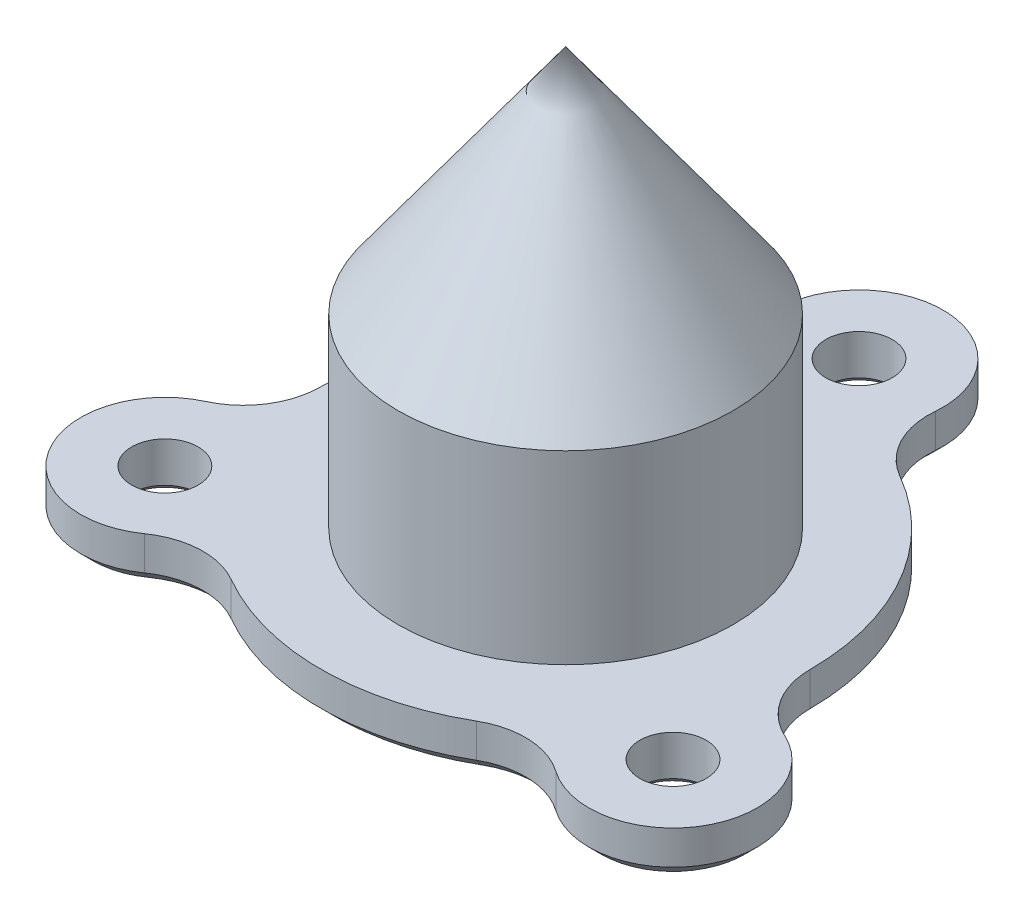
ISO-10303-21;
HEADER;
FILE_DESCRIPTION(('STEP AP214'),'2;1');
FILE_NAME('part.step','',(''),(''),'','','');
FILE_SCHEMA(('AUTOMOTIVE_DESIGN { 1 0 10303 214 1 1 1 1 }'));
ENDSEC;
DATA;
#1=APPLICATION_CONTEXT('core data for automotive mechanical design processes');
#2=APPLICATION_PROTOCOL_DEFINITION('international standard','automotive_design',2000,#1);
#3=PRODUCT_CONTEXT('',#1,'mechanical');
#4=PRODUCT('Part','Part','',(#3));
#5=PRODUCT_RELATED_PRODUCT_CATEGORY('part','',(#4));
#6=PRODUCT_DEFINITION_FORMATION('','',#4);
#7=PRODUCT_DEFINITION_CONTEXT('part definition',#1,'design');
#8=PRODUCT_DEFINITION('design','',#6,#7);
#9=PRODUCT_DEFINITION_SHAPE('','',#8);
#10=(LENGTH_UNIT() NAMED_UNIT(*) SI_UNIT(.MILLI.,.METRE.));
#11=(NAMED_UNIT(*) PLANE_ANGLE_UNIT() SI_UNIT($,.RADIAN.));
#12=(NAMED_UNIT(*) SI_UNIT($,.STERADIAN.) SOLID_ANGLE_UNIT());
#13=UNCERTAINTY_MEASURE_WITH_UNIT(LENGTH_MEASURE(1.E-05),#10,'distance_accuracy_value','');
#14=(GEOMETRIC_REPRESENTATION_CONTEXT(3) GLOBAL_UNCERTAINTY_ASSIGNED_CONTEXT((#13)) GLOBAL_UNIT_ASSIGNED_CONTEXT((#10,
#11,#12)) REPRESENTATION_CONTEXT('',''));
#15=CARTESIAN_POINT('',(0.,0.,0.));
#16=DIRECTION('',(0.,0.,1.));
#17=DIRECTION('',(1.,0.,0.));
#18=AXIS2_PLACEMENT_3D('',#15,#16,#17);
#19=CARTESIAN_POINT('',(5.20410255939998,3.,-9.03315789473684));
#20=DIRECTION('',(0.,1.,0.));
#21=DIRECTION('',(0.,0.,1.));
#22=AXIS2_PLACEMENT_3D('',#19,#20,#21);
#23=PLANE('',#22);
#24=CARTESIAN_POINT('',(16.4544826719043,3.,9.50000000000008));
#25=DIRECTION('',(0.,1.,0.));
#26=DIRECTION('',(0.,0.,1.));
#27=AXIS2_PLACEMENT_3D('',#24,#25,#26);
#28=CIRCLE('',#27,2.15);
#29=CARTESIAN_POINT('',(16.4544826719043,3.,11.6500000000001));
#30=VERTEX_POINT('',#29);
#31=EDGE_CURVE('E178',#30,#30,#28,.T.);
#32=ORIENTED_EDGE('',*,*,#31,.F.);
#33=EDGE_LOOP('',(#32));
#34=FACE_BOUND('',#33,.T.);
#35=CARTESIAN_POINT('',(0.,3.,0.));
#36=DIRECTION('',(0.,1.,0.));
#37=DIRECTION('',(0.,0.,1.));
#38=AXIS2_PLACEMENT_3D('',#35,#36,#37);
#39=CIRCLE('',#38,10.85);
#40=CARTESIAN_POINT('',(0.,3.,10.85));
#41=VERTEX_POINT('',#40);
#42=EDGE_CURVE('E189',#41,#41,#39,.T.);
#43=ORIENTED_EDGE('',*,*,#42,.F.);
#44=EDGE_LOOP('',(#43));
#45=FACE_BOUND('',#44,.T.);
#46=CARTESIAN_POINT('',(0.,3.,0.));
#47=DIRECTION('',(0.,1.,0.));
#48=DIRECTION('',(0.,0.,1.));
#49=AXIS2_PLACEMENT_3D('',#46,#47,#48);
#50=CIRCLE('',#49,15.85);
#51=CARTESIAN_POINT('',(15.8499931475365,3.,0.0147384885755792));
#52=VERTEX_POINT('',#51);
#53=CARTESIAN_POINT('',(7.91223266824842,3.,-13.7338659598637));
#54=VERTEX_POINT('',#53);
#55=EDGE_CURVE('E192',#52,#54,#50,.T.);
#56=ORIENTED_EDGE('',*,*,#55,.T.);
#57=CARTESIAN_POINT('',(10.4082051188,3.,-18.0663157894737));
#58=DIRECTION('',(0.,-1.,0.));
#59=DIRECTION('',(0.,0.,1.));
#60=AXIS2_PLACEMENT_3D('',#57,#58,#59);
#61=CIRCLE('',#60,5.);
#62=CARTESIAN_POINT('',(5.42820266961338,3.,-18.5130546461848));
#63=VERTEX_POINT('',#62);
#64=EDGE_CURVE('E195',#54,#63,#61,.T.);
#65=ORIENTED_EDGE('',*,*,#64,.T.);
#66=CARTESIAN_POINT('',(0.,3.,-19.));
#67=DIRECTION('',(0.,1.,0.));
#68=DIRECTION('',(0.,0.,1.));
#69=AXIS2_PLACEMENT_3D('',#66,#67,#68);
#70=CIRCLE('',#69,5.45);
#71=CARTESIAN_POINT('',(-5.42820266961338,3.,-18.5130546461848));
#72=VERTEX_POINT('',#71);
#73=EDGE_CURVE('E197',#63,#72,#70,.T.);
#74=ORIENTED_EDGE('',*,*,#73,.T.);
#75=CARTESIAN_POINT('',(-10.4082051188,3.,-18.0663157894737));
#76=DIRECTION('',(0.,-1.,0.));
#77=DIRECTION('',(0.,0.,-1.));
#78=AXIS2_PLACEMENT_3D('',#75,#76,#77);
#79=CIRCLE('',#78,5.);
#80=CARTESIAN_POINT('',(-7.91223266824842,3.,-13.7338659598637));
#81=VERTEX_POINT('',#80);
#82=EDGE_CURVE('E199',#72,#81,#79,.T.);
#83=ORIENTED_EDGE('',*,*,#82,.T.);
#84=CARTESIAN_POINT('',(0.,3.,0.));
#85=DIRECTION('',(0.,1.,0.));
#86=DIRECTION('',(0.,0.,1.));
#87=AXIS2_PLACEMENT_3D('',#84,#85,#86);
#88=CIRCLE('',#87,15.85);
#89=CARTESIAN_POINT('',(-15.8499931475365,3.,0.014738488575585));
#90=VERTEX_POINT('',#89);
#91=EDGE_CURVE('E201',#81,#90,#88,.T.);
#92=ORIENTED_EDGE('',*,*,#91,.T.);
#93=CARTESIAN_POINT('',(-20.8499909858761,3.,0.0193878540568474));
#94=DIRECTION('',(0.,-1.,0.));
#95=DIRECTION('',(0.,0.,1.));
#96=AXIS2_PLACEMENT_3D('',#93,#94,#95);
#97=CIRCLE('',#96,5.);
#98=CARTESIAN_POINT('',(-18.7468769600523,3.,4.55556591431673));
#99=VERTEX_POINT('',#98);
#100=EDGE_CURVE('E203',#90,#99,#97,.T.);
#101=ORIENTED_EDGE('',*,*,#100,.T.);
#102=CARTESIAN_POINT('',(-16.4544826719044,3.,9.49999999999985));
#103=DIRECTION('',(0.,1.,0.));
#104=DIRECTION('',(0.,0.,1.));
#105=AXIS2_PLACEMENT_3D('',#102,#103,#104);
#106=CIRCLE('',#105,5.45);
#107=CARTESIAN_POINT('',(-13.318674290439,3.,13.957488731868));
#108=VERTEX_POINT('',#107);
#109=EDGE_CURVE('E205',#99,#108,#106,.T.);
#110=ORIENTED_EDGE('',*,*,#109,.T.);
#111=CARTESIAN_POINT('',(-10.4417858670761,3.,18.0469279354169));
#112=DIRECTION('',(0.,-1.,0.));
#113=DIRECTION('',(0.,0.,-1.));
#114=AXIS2_PLACEMENT_3D('',#111,#112,#113);
#115=CIRCLE('',#114,5.);
#116=CARTESIAN_POINT('',(-7.93776047928809,3.,13.7191274712881));
#117=VERTEX_POINT('',#116);
#118=EDGE_CURVE('E207',#108,#117,#115,.T.);
#119=ORIENTED_EDGE('',*,*,#118,.T.);
#120=CARTESIAN_POINT('',(0.,3.,0.));
#121=DIRECTION('',(0.,1.,0.));
#122=DIRECTION('',(0.,0.,1.));
#123=AXIS2_PLACEMENT_3D('',#120,#121,#122);
#124=CIRCLE('',#123,15.85);
#125=CARTESIAN_POINT('',(7.93776047928811,3.,13.7191274712881));
#126=VERTEX_POINT('',#125);
#127=EDGE_CURVE('E209',#117,#126,#124,.T.);
#128=ORIENTED_EDGE('',*,*,#127,.T.);
#129=CARTESIAN_POINT('',(10.4417858670761,3.,18.0469279354168));
#130=DIRECTION('',(0.,-1.,0.));
#131=DIRECTION('',(0.,0.,1.));
#132=AXIS2_PLACEMENT_3D('',#129,#130,#131);
#133=CIRCLE('',#132,5.);
#134=CARTESIAN_POINT('',(13.3186742904389,3.,13.9574887318681));
#135=VERTEX_POINT('',#134);
#136=EDGE_CURVE('E211',#126,#135,#133,.T.);
#137=ORIENTED_EDGE('',*,*,#136,.T.);
#138=CARTESIAN_POINT('',(16.4544826719043,3.,9.50000000000008));
#139=DIRECTION('',(0.,1.,0.));
#140=DIRECTION('',(0.,0.,1.));
#141=AXIS2_PLACEMENT_3D('',#138,#139,#140);
#142=CIRCLE('',#141,5.45);
#143=CARTESIAN_POINT('',(18.7468769600523,3.,4.55556591431681));
#144=VERTEX_POINT('',#143);
#145=EDGE_CURVE('E213',#135,#144,#142,.T.);
#146=ORIENTED_EDGE('',*,*,#145,.T.);
#147=CARTESIAN_POINT('',(20.8499909858761,3.,0.0193878540568318));
#148=DIRECTION('',(0.,-1.,0.));
#149=DIRECTION('',(0.,0.,-1.));
#150=AXIS2_PLACEMENT_3D('',#147,#148,#149);
#151=CIRCLE('',#150,5.00000000000001);
#152=EDGE_CURVE('E215',#144,#52,#151,.T.);
#153=ORIENTED_EDGE('',*,*,#152,.T.);
#154=EDGE_LOOP('',(#56,#65,#74,#83,#92,#101,#110,#119,#128,#137,#146,#153));
#155=FACE_BOUND('',#154,.T.);
#156=CARTESIAN_POINT('',(0.,3.,-19.));
#157=DIRECTION('',(0.,1.,0.));
#158=DIRECTION('',(0.,0.,1.));
#159=AXIS2_PLACEMENT_3D('',#156,#157,#158);
#160=CIRCLE('',#159,2.15);
#161=CARTESIAN_POINT('',(0.,3.,-16.85));
#162=VERTEX_POINT('',#161);
#163=EDGE_CURVE('E186',#162,#162,#160,.T.);
#164=ORIENTED_EDGE('',*,*,#163,.F.);
#165=EDGE_LOOP('',(#164));
#166=FACE_BOUND('',#165,.T.);
#167=CARTESIAN_POINT('',(-16.4544826719044,3.,9.49999999999985));
#168=DIRECTION('',(0.,1.,0.));
#169=DIRECTION('',(0.,0.,1.));
#170=AXIS2_PLACEMENT_3D('',#167,#168,#169);
#171=CIRCLE('',#170,2.15);
#172=CARTESIAN_POINT('',(-16.4544826719044,3.,11.6499999999999));
#173=VERTEX_POINT('',#172);
#174=EDGE_CURVE('E174',#173,#173,#171,.T.);
#175=ORIENTED_EDGE('',*,*,#174,.F.);
#176=EDGE_LOOP('',(#175));
#177=FACE_BOUND('',#176,.T.);
#178=ADVANCED_FACE('F35',(#34,#45,#155,#166,#177),#23,.T.);
#179=CARTESIAN_POINT('',(5.20410255939998,0.,-9.03315789473684));
#180=DIRECTION('',(0.,1.,0.));
#181=DIRECTION('',(0.,0.,1.));
#182=AXIS2_PLACEMENT_3D('',#179,#180,#181);
#183=PLANE('',#182);
#184=CARTESIAN_POINT('',(-16.4544826719044,0.,9.49999999999985));
#185=DIRECTION('',(0.,1.,0.));
#186=DIRECTION('',(0.,0.,1.));
#187=AXIS2_PLACEMENT_3D('',#184,#185,#186);
#188=CIRCLE('',#187,2.54999999999999);
#189=CARTESIAN_POINT('',(-16.4544826719044,0.,12.0499999999998));
#190=VERTEX_POINT('',#189);
#191=EDGE_CURVE('E334',#190,#190,#188,.T.);
#192=ORIENTED_EDGE('',*,*,#191,.T.);
#193=EDGE_LOOP('',(#192));
#194=FACE_BOUND('',#193,.T.);
#195=CARTESIAN_POINT('',(16.4544826719043,0.,9.50000000000008));
#196=DIRECTION('',(0.,1.,0.));
#197=DIRECTION('',(0.,0.,1.));
#198=AXIS2_PLACEMENT_3D('',#195,#196,#197);
#199=CIRCLE('',#198,2.55);
#200=CARTESIAN_POINT('',(16.4544826719043,0.,12.0500000000001));
#201=VERTEX_POINT('',#200);
#202=EDGE_CURVE('E331',#201,#201,#199,.T.);
#203=ORIENTED_EDGE('',*,*,#202,.T.);
#204=EDGE_LOOP('',(#203));
#205=FACE_BOUND('',#204,.T.);
#206=CARTESIAN_POINT('',(0.,0.,-19.));
#207=DIRECTION('',(0.,1.,0.));
#208=DIRECTION('',(0.,0.,1.));
#209=AXIS2_PLACEMENT_3D('',#206,#207,#208);
#210=CIRCLE('',#209,2.55);
#211=CARTESIAN_POINT('',(0.,0.,-16.45));
#212=VERTEX_POINT('',#211);
#213=EDGE_CURVE('E298',#212,#212,#210,.T.);
#214=ORIENTED_EDGE('',*,*,#213,.T.);
#215=EDGE_LOOP('',(#214));
#216=FACE_BOUND('',#215,.T.);
#217=CARTESIAN_POINT('',(-10.4082051188,0.,-18.0663157894737));
#218=DIRECTION('',(0.,1.,0.));
#219=DIRECTION('',(0.,0.,1.));
#220=AXIS2_PLACEMENT_3D('',#217,#218,#219);
#221=CIRCLE('',#220,5.8);
#222=CARTESIAN_POINT('',(-7.51287707616017,0.,-13.0406739871261));
#223=VERTEX_POINT('',#222);
#224=CARTESIAN_POINT('',(-4.63140227774353,0.,-18.5845328632586));
#225=VERTEX_POINT('',#224);
#226=EDGE_CURVE('E273',#223,#225,#221,.T.);
#227=ORIENTED_EDGE('',*,*,#226,.T.);
#228=CARTESIAN_POINT('',(0.,0.,-19.));
#229=DIRECTION('',(0.,1.,0.));
#230=DIRECTION('',(0.,0.,1.));
#231=AXIS2_PLACEMENT_3D('',#228,#229,#230);
#232=CIRCLE('',#231,4.65);
#233=CARTESIAN_POINT('',(4.63140227774353,0.,-18.5845328632586));
#234=VERTEX_POINT('',#233);
#235=EDGE_CURVE('E275',#225,#234,#232,.F.);
#236=ORIENTED_EDGE('',*,*,#235,.T.);
#237=CARTESIAN_POINT('',(10.4082051188,0.,-18.0663157894737));
#238=DIRECTION('',(0.,1.,0.));
#239=DIRECTION('',(0.,0.,1.));
#240=AXIS2_PLACEMENT_3D('',#237,#238,#239);
#241=CIRCLE('',#240,5.8);
#242=CARTESIAN_POINT('',(7.51287707616017,0.,-13.0406739871261));
#243=VERTEX_POINT('',#242);
#244=EDGE_CURVE('E271',#234,#243,#241,.T.);
#245=ORIENTED_EDGE('',*,*,#244,.T.);
#246=CARTESIAN_POINT('',(0.,0.,0.));
#247=DIRECTION('',(0.,1.,0.));
#248=DIRECTION('',(0.,0.,1.));
#249=AXIS2_PLACEMENT_3D('',#246,#247,#248);
#250=CIRCLE('',#249,15.05);
#251=CARTESIAN_POINT('',(15.0499934934022,0.,0.0139945900985783));
#252=VERTEX_POINT('',#251);
#253=EDGE_CURVE('E267',#243,#252,#250,.F.);
#254=ORIENTED_EDGE('',*,*,#253,.T.);
#255=CARTESIAN_POINT('',(20.8499909858761,0.,0.0193878540568318));
#256=DIRECTION('',(0.,1.,0.));
#257=DIRECTION('',(0.,0.,1.));
#258=AXIS2_PLACEMENT_3D('',#255,#256,#257);
#259=CIRCLE('',#258,5.8);
#260=CARTESIAN_POINT('',(18.4103787159204,0.,5.28135440395839));
#261=VERTEX_POINT('',#260);
#262=EDGE_CURVE('E263',#252,#261,#259,.T.);
#263=ORIENTED_EDGE('',*,*,#262,.T.);
#264=CARTESIAN_POINT('',(16.4544826719043,0.,9.50000000000008));
#265=DIRECTION('',(0.,1.,0.));
#266=DIRECTION('',(0.,0.,1.));
#267=AXIS2_PLACEMENT_3D('',#264,#265,#266);
#268=CIRCLE('',#267,4.65);
#269=CARTESIAN_POINT('',(13.778976438177,0.,13.3031784593003));
#270=VERTEX_POINT('',#269);
#271=EDGE_CURVE('E259',#261,#270,#268,.F.);
#272=ORIENTED_EDGE('',*,*,#271,.T.);
#273=CARTESIAN_POINT('',(10.4417858670761,0.,18.0469279354168));
#274=DIRECTION('',(0.,1.,0.));
#275=DIRECTION('',(0.,0.,1.));
#276=AXIS2_PLACEMENT_3D('',#273,#274,#275);
#277=CIRCLE('',#276,5.8);
#278=CARTESIAN_POINT('',(7.53711641724202,0.,13.0266793970275));
#279=VERTEX_POINT('',#278);
#280=EDGE_CURVE('E255',#270,#279,#277,.T.);
#281=ORIENTED_EDGE('',*,*,#280,.T.);
#282=CARTESIAN_POINT('',(0.,0.,0.));
#283=DIRECTION('',(0.,1.,0.));
#284=DIRECTION('',(0.,0.,1.));
#285=AXIS2_PLACEMENT_3D('',#282,#283,#284);
#286=CIRCLE('',#285,15.05);
#287=CARTESIAN_POINT('',(-7.537116417242,0.,13.0266793970275));
#288=VERTEX_POINT('',#287);
#289=EDGE_CURVE('E253',#279,#288,#286,.F.);
#290=ORIENTED_EDGE('',*,*,#289,.T.);
#291=CARTESIAN_POINT('',(-10.4417858670761,0.,18.0469279354169));
#292=DIRECTION('',(0.,1.,0.));
#293=DIRECTION('',(0.,0.,1.));
#294=AXIS2_PLACEMENT_3D('',#291,#292,#293);
#295=CIRCLE('',#294,5.8);
#296=CARTESIAN_POINT('',(-13.7789764381769,0.,13.3031784593003));
#297=VERTEX_POINT('',#296);
#298=EDGE_CURVE('E257',#288,#297,#295,.T.);
#299=ORIENTED_EDGE('',*,*,#298,.T.);
#300=CARTESIAN_POINT('',(-16.4544826719044,0.,9.49999999999985));
#301=DIRECTION('',(0.,1.,0.));
#302=DIRECTION('',(0.,0.,1.));
#303=AXIS2_PLACEMENT_3D('',#300,#301,#302);
#304=CIRCLE('',#303,4.65);
#305=CARTESIAN_POINT('',(-18.4103787159206,0.,5.28135440395815));
#306=VERTEX_POINT('',#305);
#307=EDGE_CURVE('E261',#297,#306,#304,.F.);
#308=ORIENTED_EDGE('',*,*,#307,.T.);
#309=CARTESIAN_POINT('',(-20.8499909858761,0.,0.0193878540568474));
#310=DIRECTION('',(0.,1.,0.));
#311=DIRECTION('',(0.,0.,1.));
#312=AXIS2_PLACEMENT_3D('',#309,#310,#311);
#313=CIRCLE('',#312,5.8);
#314=CARTESIAN_POINT('',(-15.0499934934022,0.,0.0139945900985839));
#315=VERTEX_POINT('',#314);
#316=EDGE_CURVE('E265',#306,#315,#313,.T.);
#317=ORIENTED_EDGE('',*,*,#316,.T.);
#318=CARTESIAN_POINT('',(0.,0.,0.));
#319=DIRECTION('',(0.,1.,0.));
#320=DIRECTION('',(0.,0.,1.));
#321=AXIS2_PLACEMENT_3D('',#318,#319,#320);
#322=CIRCLE('',#321,15.05);
#323=EDGE_CURVE('E269',#315,#223,#322,.F.);
#324=ORIENTED_EDGE('',*,*,#323,.T.);
#325=EDGE_LOOP('',(#227,#236,#245,#254,#263,#272,#281,#290,#299,#308,#317,#324));
#326=FACE_BOUND('',#325,.T.);
#327=ADVANCED_FACE('F351',(#194,#205,#216,#326),#183,.F.);
#328=CARTESIAN_POINT('',(0.,3.,0.));
#329=DIRECTION('',(0.,-1.,0.));
#330=DIRECTION('',(0.,0.,-1.));
#331=AXIS2_PLACEMENT_3D('',#328,#329,#330);
#332=CYLINDRICAL_SURFACE('',#331,15.85);
#333=DIRECTION('',(0.,-1.,0.));
#334=VECTOR('',#333,1.);
#335=CARTESIAN_POINT('',(15.8499931475365,3.,0.0147384885755792));
#336=LINE('',#335,#334);
#337=CARTESIAN_POINT('',(15.8499931475365,0.799999999999992,0.0147384885755792));
#338=VERTEX_POINT('',#337);
#339=EDGE_CURVE('E217',#52,#338,#336,.T.);
#340=ORIENTED_EDGE('',*,*,#339,.T.);
#341=CARTESIAN_POINT('',(0.,0.799999999999992,0.));
#342=DIRECTION('',(0.,1.,0.));
#343=DIRECTION('',(0.,0.,1.));
#344=AXIS2_PLACEMENT_3D('',#341,#342,#343);
#345=CIRCLE('',#344,15.85);
#346=CARTESIAN_POINT('',(7.91223266824842,0.799999999999992,-13.7338659598637));
#347=VERTEX_POINT('',#346);
#348=EDGE_CURVE('E284',#338,#347,#345,.T.);
#349=ORIENTED_EDGE('',*,*,#348,.T.);
#350=DIRECTION('',(0.,-1.,0.));
#351=VECTOR('',#350,1.);
#352=CARTESIAN_POINT('',(7.91223266824842,3.,-13.7338659598637));
#353=LINE('',#352,#351);
#354=EDGE_CURVE('E247',#54,#347,#353,.T.);
#355=ORIENTED_EDGE('',*,*,#354,.F.);
#356=ORIENTED_EDGE('',*,*,#55,.F.);
#357=EDGE_LOOP('',(#340,#349,#355,#356));
#358=FACE_BOUND('',#357,.T.);
#359=ADVANCED_FACE('F354',(#358),#332,.T.);
#360=CARTESIAN_POINT('',(10.4082051188,3.,-18.0663157894737));
#361=DIRECTION('',(0.,-1.,0.));
#362=DIRECTION('',(0.,0.,-1.));
#363=AXIS2_PLACEMENT_3D('',#360,#361,#362);
#364=CYLINDRICAL_SURFACE('',#363,5.);
#365=ORIENTED_EDGE('',*,*,#354,.T.);
#366=CARTESIAN_POINT('',(10.4082051188,0.799999999999992,-18.0663157894737));
#367=DIRECTION('',(0.,1.,0.));
#368=DIRECTION('',(0.,0.,1.));
#369=AXIS2_PLACEMENT_3D('',#366,#367,#368);
#370=CIRCLE('',#369,5.);
#371=CARTESIAN_POINT('',(5.42820266961338,0.799999999999992,-18.5130546461848));
#372=VERTEX_POINT('',#371);
#373=EDGE_CURVE('E280',#347,#372,#370,.F.);
#374=ORIENTED_EDGE('',*,*,#373,.T.);
#375=DIRECTION('',(0.,-1.,0.));
#376=VECTOR('',#375,1.);
#377=CARTESIAN_POINT('',(5.42820266961338,3.,-18.5130546461848));
#378=LINE('',#377,#376);
#379=EDGE_CURVE('E244',#63,#372,#378,.T.);
#380=ORIENTED_EDGE('',*,*,#379,.F.);
#381=ORIENTED_EDGE('',*,*,#64,.F.);
#382=EDGE_LOOP('',(#365,#374,#380,#381));
#383=FACE_BOUND('',#382,.T.);
#384=ADVANCED_FACE('F388',(#383),#364,.F.);
#385=CARTESIAN_POINT('',(0.,3.,-19.));
#386=DIRECTION('',(0.,-1.,0.));
#387=DIRECTION('',(0.,0.,-1.));
#388=AXIS2_PLACEMENT_3D('',#385,#386,#387);
#389=CYLINDRICAL_SURFACE('',#388,5.45);
#390=ORIENTED_EDGE('',*,*,#379,.T.);
#391=CARTESIAN_POINT('',(0.,0.799999999999992,-19.));
#392=DIRECTION('',(0.,1.,0.));
#393=DIRECTION('',(0.,0.,1.));
#394=AXIS2_PLACEMENT_3D('',#391,#392,#393);
#395=CIRCLE('',#394,5.45);
#396=CARTESIAN_POINT('',(-5.42820266961338,0.799999999999992,-18.5130546461848));
#397=VERTEX_POINT('',#396);
#398=EDGE_CURVE('E250',#372,#397,#395,.T.);
#399=ORIENTED_EDGE('',*,*,#398,.T.);
#400=DIRECTION('',(0.,-1.,0.));
#401=VECTOR('',#400,1.);
#402=CARTESIAN_POINT('',(-5.42820266961338,3.,-18.5130546461848));
#403=LINE('',#402,#401);
#404=EDGE_CURVE('E241',#72,#397,#403,.T.);
#405=ORIENTED_EDGE('',*,*,#404,.F.);
#406=ORIENTED_EDGE('',*,*,#73,.F.);
#407=EDGE_LOOP('',(#390,#399,#405,#406));
#408=FACE_BOUND('',#407,.T.);
#409=ADVANCED_FACE('F376',(#408),#389,.T.);
#410=CARTESIAN_POINT('',(-10.4082051188,3.,-18.0663157894737));
#411=DIRECTION('',(0.,-1.,0.));
#412=DIRECTION('',(0.,0.,-1.));
#413=AXIS2_PLACEMENT_3D('',#410,#411,#412);
#414=CYLINDRICAL_SURFACE('',#413,5.);
#415=ORIENTED_EDGE('',*,*,#404,.T.);
#416=CARTESIAN_POINT('',(-10.4082051188,0.799999999999992,-18.0663157894737));
#417=DIRECTION('',(0.,1.,0.));
#418=DIRECTION('',(0.,0.,1.));
#419=AXIS2_PLACEMENT_3D('',#416,#417,#418);
#420=CIRCLE('',#419,5.);
#421=CARTESIAN_POINT('',(-7.91223266824842,0.799999999999992,-13.7338659598637));
#422=VERTEX_POINT('',#421);
#423=EDGE_CURVE('E278',#397,#422,#420,.F.);
#424=ORIENTED_EDGE('',*,*,#423,.T.);
#425=DIRECTION('',(0.,-1.,0.));
#426=VECTOR('',#425,1.);
#427=CARTESIAN_POINT('',(-7.91223266824842,3.,-13.7338659598637));
#428=LINE('',#427,#426);
#429=EDGE_CURVE('E238',#81,#422,#428,.T.);
#430=ORIENTED_EDGE('',*,*,#429,.F.);
#431=ORIENTED_EDGE('',*,*,#82,.F.);
#432=EDGE_LOOP('',(#415,#424,#430,#431));
#433=FACE_BOUND('',#432,.T.);
#434=ADVANCED_FACE('F380',(#433),#414,.F.);
#435=CARTESIAN_POINT('',(0.,3.,0.));
#436=DIRECTION('',(0.,-1.,0.));
#437=DIRECTION('',(0.,0.,-1.));
#438=AXIS2_PLACEMENT_3D('',#435,#436,#437);
#439=CYLINDRICAL_SURFACE('',#438,15.85);
#440=ORIENTED_EDGE('',*,*,#429,.T.);
#441=CARTESIAN_POINT('',(0.,0.799999999999992,0.));
#442=DIRECTION('',(0.,1.,0.));
#443=DIRECTION('',(0.,0.,1.));
#444=AXIS2_PLACEMENT_3D('',#441,#442,#443);
#445=CIRCLE('',#444,15.85);
#446=CARTESIAN_POINT('',(-15.8499931475365,0.799999999999992,0.014738488575585));
#447=VERTEX_POINT('',#446);
#448=EDGE_CURVE('E282',#422,#447,#445,.T.);
#449=ORIENTED_EDGE('',*,*,#448,.T.);
#450=DIRECTION('',(0.,-1.,0.));
#451=VECTOR('',#450,1.);
#452=CARTESIAN_POINT('',(-15.8499931475365,3.,0.014738488575585));
#453=LINE('',#452,#451);
#454=EDGE_CURVE('E235',#90,#447,#453,.T.);
#455=ORIENTED_EDGE('',*,*,#454,.F.);
#456=ORIENTED_EDGE('',*,*,#91,.F.);
#457=EDGE_LOOP('',(#440,#449,#455,#456));
#458=FACE_BOUND('',#457,.T.);
#459=ADVANCED_FACE('F434',(#458),#439,.T.);
#460=CARTESIAN_POINT('',(-20.8499909858761,3.,0.0193878540568474));
#461=DIRECTION('',(0.,-1.,0.));
#462=DIRECTION('',(0.,0.,-1.));
#463=AXIS2_PLACEMENT_3D('',#460,#461,#462);
#464=CYLINDRICAL_SURFACE('',#463,5.);
#465=ORIENTED_EDGE('',*,*,#454,.T.);
#466=CARTESIAN_POINT('',(-20.8499909858761,0.799999999999992,0.0193878540568474));
#467=DIRECTION('',(0.,1.,0.));
#468=DIRECTION('',(0.,0.,1.));
#469=AXIS2_PLACEMENT_3D('',#466,#467,#468);
#470=CIRCLE('',#469,5.);
#471=CARTESIAN_POINT('',(-18.7468769600523,0.799999999999992,4.55556591431673));
#472=VERTEX_POINT('',#471);
#473=EDGE_CURVE('E286',#447,#472,#470,.F.);
#474=ORIENTED_EDGE('',*,*,#473,.T.);
#475=DIRECTION('',(0.,-1.,0.));
#476=VECTOR('',#475,1.);
#477=CARTESIAN_POINT('',(-18.7468769600523,3.,4.55556591431673));
#478=LINE('',#477,#476);
#479=EDGE_CURVE('E232',#99,#472,#478,.T.);
#480=ORIENTED_EDGE('',*,*,#479,.F.);
#481=ORIENTED_EDGE('',*,*,#100,.F.);
#482=EDGE_LOOP('',(#465,#474,#480,#481));
#483=FACE_BOUND('',#482,.T.);
#484=ADVANCED_FACE('F437',(#483),#464,.F.);
#485=CARTESIAN_POINT('',(-16.4544826719044,3.,9.49999999999985));
#486=DIRECTION('',(0.,-1.,0.));
#487=DIRECTION('',(0.,0.,-1.));
#488=AXIS2_PLACEMENT_3D('',#485,#486,#487);
#489=CYLINDRICAL_SURFACE('',#488,5.45);
#490=ORIENTED_EDGE('',*,*,#479,.T.);
#491=CARTESIAN_POINT('',(-16.4544826719044,0.799999999999992,9.49999999999985));
#492=DIRECTION('',(0.,1.,0.));
#493=DIRECTION('',(0.,0.,1.));
#494=AXIS2_PLACEMENT_3D('',#491,#492,#493);
#495=CIRCLE('',#494,5.45);
#496=CARTESIAN_POINT('',(-13.318674290439,0.799999999999992,13.957488731868));
#497=VERTEX_POINT('',#496);
#498=EDGE_CURVE('E290',#472,#497,#495,.T.);
#499=ORIENTED_EDGE('',*,*,#498,.T.);
#500=DIRECTION('',(0.,-1.,0.));
#501=VECTOR('',#500,1.);
#502=CARTESIAN_POINT('',(-13.318674290439,3.,13.957488731868));
#503=LINE('',#502,#501);
#504=EDGE_CURVE('E230',#108,#497,#503,.T.);
#505=ORIENTED_EDGE('',*,*,#504,.F.);
#506=ORIENTED_EDGE('',*,*,#109,.F.);
#507=EDGE_LOOP('',(#490,#499,#505,#506));
#508=FACE_BOUND('',#507,.T.);
#509=ADVANCED_FACE('F443',(#508),#489,.T.);
#510=CARTESIAN_POINT('',(-10.4417858670761,3.,18.0469279354169));
#511=DIRECTION('',(0.,-1.,0.));
#512=DIRECTION('',(0.,0.,-1.));
#513=AXIS2_PLACEMENT_3D('',#510,#511,#512);
#514=CYLINDRICAL_SURFACE('',#513,5.);
#515=ORIENTED_EDGE('',*,*,#504,.T.);
#516=CARTESIAN_POINT('',(-10.4417858670761,0.799999999999992,18.0469279354169));
#517=DIRECTION('',(0.,1.,0.));
#518=DIRECTION('',(0.,0.,1.));
#519=AXIS2_PLACEMENT_3D('',#516,#517,#518);
#520=CIRCLE('',#519,5.);
#521=CARTESIAN_POINT('',(-7.93776047928809,0.799999999999992,13.7191274712881));
#522=VERTEX_POINT('',#521);
#523=EDGE_CURVE('E58',#497,#522,#520,.F.);
#524=ORIENTED_EDGE('',*,*,#523,.T.);
#525=DIRECTION('',(0.,-1.,0.));
#526=VECTOR('',#525,1.);
#527=CARTESIAN_POINT('',(-7.93776047928809,3.,13.7191274712881));
#528=LINE('',#527,#526);
#529=EDGE_CURVE('E228',#117,#522,#528,.T.);
#530=ORIENTED_EDGE('',*,*,#529,.F.);
#531=ORIENTED_EDGE('',*,*,#118,.F.);
#532=EDGE_LOOP('',(#515,#524,#530,#531));
#533=FACE_BOUND('',#532,.T.);
#534=ADVANCED_FACE('F444',(#533),#514,.F.);
#535=CARTESIAN_POINT('',(0.,3.,0.));
#536=DIRECTION('',(0.,-1.,0.));
#537=DIRECTION('',(0.,0.,-1.));
#538=AXIS2_PLACEMENT_3D('',#535,#536,#537);
#539=CYLINDRICAL_SURFACE('',#538,15.85);
#540=ORIENTED_EDGE('',*,*,#529,.T.);
#541=CARTESIAN_POINT('',(0.,0.799999999999992,0.));
#542=DIRECTION('',(0.,1.,0.));
#543=DIRECTION('',(0.,0.,1.));
#544=AXIS2_PLACEMENT_3D('',#541,#542,#543);
#545=CIRCLE('',#544,15.85);
#546=CARTESIAN_POINT('',(7.93776047928811,0.799999999999992,13.7191274712881));
#547=VERTEX_POINT('',#546);
#548=EDGE_CURVE('E50',#522,#547,#545,.T.);
#549=ORIENTED_EDGE('',*,*,#548,.T.);
#550=DIRECTION('',(0.,-1.,0.));
#551=VECTOR('',#550,1.);
#552=CARTESIAN_POINT('',(7.93776047928811,3.,13.7191274712881));
#553=LINE('',#552,#551);
#554=EDGE_CURVE('E226',#126,#547,#553,.T.);
#555=ORIENTED_EDGE('',*,*,#554,.F.);
#556=ORIENTED_EDGE('',*,*,#127,.F.);
#557=EDGE_LOOP('',(#540,#549,#555,#556));
#558=FACE_BOUND('',#557,.T.);
#559=ADVANCED_FACE('F446',(#558),#539,.T.);
#560=CARTESIAN_POINT('',(10.4417858670761,3.,18.0469279354168));
#561=DIRECTION('',(0.,-1.,0.));
#562=DIRECTION('',(0.,0.,-1.));
#563=AXIS2_PLACEMENT_3D('',#560,#561,#562);
#564=CYLINDRICAL_SURFACE('',#563,5.);
#565=ORIENTED_EDGE('',*,*,#554,.T.);
#566=CARTESIAN_POINT('',(10.4417858670761,0.799999999999992,18.0469279354168));
#567=DIRECTION('',(0.,1.,0.));
#568=DIRECTION('',(0.,0.,1.));
#569=AXIS2_PLACEMENT_3D('',#566,#567,#568);
#570=CIRCLE('',#569,5.);
#571=CARTESIAN_POINT('',(13.3186742904389,0.799999999999992,13.9574887318681));
#572=VERTEX_POINT('',#571);
#573=EDGE_CURVE('E295',#547,#572,#570,.F.);
#574=ORIENTED_EDGE('',*,*,#573,.T.);
#575=DIRECTION('',(0.,-1.,0.));
#576=VECTOR('',#575,1.);
#577=CARTESIAN_POINT('',(13.3186742904389,3.,13.9574887318681));
#578=LINE('',#577,#576);
#579=EDGE_CURVE('E223',#135,#572,#578,.T.);
#580=ORIENTED_EDGE('',*,*,#579,.F.);
#581=ORIENTED_EDGE('',*,*,#136,.F.);
#582=EDGE_LOOP('',(#565,#574,#580,#581));
#583=FACE_BOUND('',#582,.T.);
#584=ADVANCED_FACE('F452',(#583),#564,.F.);
#585=CARTESIAN_POINT('',(16.4544826719043,3.,9.50000000000008));
#586=DIRECTION('',(0.,-1.,0.));
#587=DIRECTION('',(0.,0.,-1.));
#588=AXIS2_PLACEMENT_3D('',#585,#586,#587);
#589=CYLINDRICAL_SURFACE('',#588,5.45);
#590=ORIENTED_EDGE('',*,*,#579,.T.);
#591=CARTESIAN_POINT('',(16.4544826719043,0.799999999999992,9.50000000000008));
#592=DIRECTION('',(0.,1.,0.));
#593=DIRECTION('',(0.,0.,1.));
#594=AXIS2_PLACEMENT_3D('',#591,#592,#593);
#595=CIRCLE('',#594,5.45);
#596=CARTESIAN_POINT('',(18.7468769600523,0.799999999999992,4.55556591431681));
#597=VERTEX_POINT('',#596);
#598=EDGE_CURVE('E292',#572,#597,#595,.T.);
#599=ORIENTED_EDGE('',*,*,#598,.T.);
#600=DIRECTION('',(0.,-1.,0.));
#601=VECTOR('',#600,1.);
#602=CARTESIAN_POINT('',(18.7468769600523,3.,4.55556591431681));
#603=LINE('',#602,#601);
#604=EDGE_CURVE('E220',#144,#597,#603,.T.);
#605=ORIENTED_EDGE('',*,*,#604,.F.);
#606=ORIENTED_EDGE('',*,*,#145,.F.);
#607=EDGE_LOOP('',(#590,#599,#605,#606));
#608=FACE_BOUND('',#607,.T.);
#609=ADVANCED_FACE('F454',(#608),#589,.T.);
#610=CARTESIAN_POINT('',(20.8499909858761,3.,0.0193878540568318));
#611=DIRECTION('',(0.,-1.,0.));
#612=DIRECTION('',(0.,0.,-1.));
#613=AXIS2_PLACEMENT_3D('',#610,#611,#612);
#614=CYLINDRICAL_SURFACE('',#613,5.00000000000001);
#615=ORIENTED_EDGE('',*,*,#604,.T.);
#616=CARTESIAN_POINT('',(20.8499909858761,0.799999999999992,0.0193878540568318));
#617=DIRECTION('',(0.,1.,0.));
#618=DIRECTION('',(0.,0.,1.));
#619=AXIS2_PLACEMENT_3D('',#616,#617,#618);
#620=CIRCLE('',#619,5.00000000000001);
#621=EDGE_CURVE('E288',#597,#338,#620,.F.);
#622=ORIENTED_EDGE('',*,*,#621,.T.);
#623=ORIENTED_EDGE('',*,*,#339,.F.);
#624=ORIENTED_EDGE('',*,*,#152,.F.);
#625=EDGE_LOOP('',(#615,#622,#623,#624));
#626=FACE_BOUND('',#625,.T.);
#627=ADVANCED_FACE('F458',(#626),#614,.F.);
#628=CARTESIAN_POINT('',(0.,3.,-19.));
#629=DIRECTION('',(0.,-1.,0.));
#630=DIRECTION('',(0.,0.,-1.));
#631=AXIS2_PLACEMENT_3D('',#628,#629,#630);
#632=CYLINDRICAL_SURFACE('',#631,2.15);
#633=CARTESIAN_POINT('',(0.,0.399999999999998,-19.));
#634=DIRECTION('',(0.,1.,0.));
#635=DIRECTION('',(0.,0.,1.));
#636=AXIS2_PLACEMENT_3D('',#633,#634,#635);
#637=CIRCLE('',#636,2.15);
#638=CARTESIAN_POINT('',(0.,0.399999999999998,-16.85));
#639=VERTEX_POINT('',#638);
#640=EDGE_CURVE('E11',#639,#639,#637,.F.);
#641=ORIENTED_EDGE('',*,*,#640,.T.);
#642=EDGE_LOOP('',(#641));
#643=FACE_BOUND('',#642,.T.);
#644=ORIENTED_EDGE('',*,*,#163,.T.);
#645=EDGE_LOOP('',(#644));
#646=FACE_BOUND('',#645,.T.);
#647=ADVANCED_FACE('F476',(#643,#646),#632,.F.);
#648=CARTESIAN_POINT('',(16.4544826719043,3.,9.50000000000008));
#649=DIRECTION('',(0.,-1.,0.));
#650=DIRECTION('',(0.,0.,-1.));
#651=AXIS2_PLACEMENT_3D('',#648,#649,#650);
#652=CYLINDRICAL_SURFACE('',#651,2.15);
#653=CARTESIAN_POINT('',(16.4544826719043,0.400000000000001,9.50000000000008));
#654=DIRECTION('',(0.,1.,0.));
#655=DIRECTION('',(0.,0.,1.));
#656=AXIS2_PLACEMENT_3D('',#653,#654,#655);
#657=CIRCLE('',#656,2.15);
#658=CARTESIAN_POINT('',(16.4544826719043,0.400000000000001,11.6500000000001));
#659=VERTEX_POINT('',#658);
#660=EDGE_CURVE('E43',#659,#659,#657,.F.);
#661=ORIENTED_EDGE('',*,*,#660,.T.);
#662=EDGE_LOOP('',(#661));
#663=FACE_BOUND('',#662,.T.);
#664=ORIENTED_EDGE('',*,*,#31,.T.);
#665=EDGE_LOOP('',(#664));
#666=FACE_BOUND('',#665,.T.);
#667=ADVANCED_FACE('F342',(#663,#666),#652,.F.);
#668=CARTESIAN_POINT('',(-16.4544826719044,3.,9.49999999999985));
#669=DIRECTION('',(0.,-1.,0.));
#670=DIRECTION('',(0.,0.,-1.));
#671=AXIS2_PLACEMENT_3D('',#668,#669,#670);
#672=CYLINDRICAL_SURFACE('',#671,2.15);
#673=CARTESIAN_POINT('',(-16.4544826719044,0.399999999999985,9.49999999999985));
#674=DIRECTION('',(0.,1.,0.));
#675=DIRECTION('',(0.,0.,1.));
#676=AXIS2_PLACEMENT_3D('',#673,#674,#675);
#677=CIRCLE('',#676,2.15);
#678=CARTESIAN_POINT('',(-16.4544826719044,0.399999999999985,11.6499999999999));
#679=VERTEX_POINT('',#678);
#680=EDGE_CURVE('E337',#679,#679,#677,.F.);
#681=ORIENTED_EDGE('',*,*,#680,.T.);
#682=EDGE_LOOP('',(#681));
#683=FACE_BOUND('',#682,.T.);
#684=ORIENTED_EDGE('',*,*,#174,.T.);
#685=EDGE_LOOP('',(#684));
#686=FACE_BOUND('',#685,.T.);
#687=ADVANCED_FACE('F554',(#683,#686),#672,.F.);
#688=CARTESIAN_POINT('',(0.,15.,0.));
#689=DIRECTION('',(0.,-1.,0.));
#690=DIRECTION('',(0.,0.,-1.));
#691=AXIS2_PLACEMENT_3D('',#688,#689,#690);
#692=CYLINDRICAL_SURFACE('',#691,10.85);
#693=ORIENTED_EDGE('',*,*,#42,.T.);
#694=EDGE_LOOP('',(#693));
#695=FACE_BOUND('',#694,.T.);
#696=CARTESIAN_POINT('',(0.,15.,0.));
#697=DIRECTION('',(0.,1.,0.));
#698=DIRECTION('',(0.,0.,1.));
#699=AXIS2_PLACEMENT_3D('',#696,#697,#698);
#700=CIRCLE('',#699,10.85);
#701=CARTESIAN_POINT('',(0.,15.,10.85));
#702=VERTEX_POINT('',#701);
#703=EDGE_CURVE('E172',#702,#702,#700,.T.);
#704=ORIENTED_EDGE('',*,*,#703,.F.);
#705=EDGE_LOOP('',(#704));
#706=FACE_BOUND('',#705,.T.);
#707=ADVANCED_FACE('F168',(#695,#706),#692,.T.);
#708=CARTESIAN_POINT('',(0.,15.,0.));
#709=DIRECTION('',(0.,-1.,0.));
#710=DIRECTION('',(0.,0.,-1.));
#711=AXIS2_PLACEMENT_3D('',#708,#709,#710);
#712=CONICAL_SURFACE('',#711,10.85,0.626214878328838);
#713=CARTESIAN_POINT('',(0.,30.,0.));
#714=VERTEX_POINT('',#713);
#715=VERTEX_LOOP('',#714);
#716=FACE_BOUND('',#715,.T.);
#717=ORIENTED_EDGE('',*,*,#703,.T.);
#718=EDGE_LOOP('',(#717));
#719=FACE_BOUND('',#718,.T.);
#720=ADVANCED_FACE('F164',(#716,#719),#712,.T.);
#721=CARTESIAN_POINT('',(0.,0.799999999999992,0.));
#722=DIRECTION('',(0.,1.,0.));
#723=DIRECTION('',(0.,0.,1.));
#724=AXIS2_PLACEMENT_3D('',#721,#722,#723);
#725=CONICAL_SURFACE('',#724,15.85,0.785398163397453);
#726=DIRECTION('',(-0.354122666393641,0.707106781186545,0.612043411161547));
#727=VECTOR('',#726,1.);
#728=CARTESIAN_POINT('',(-7.537116417242,0.,13.0266793970275));
#729=LINE('',#728,#727);
#730=EDGE_CURVE('E181',#288,#522,#729,.T.);
#731=ORIENTED_EDGE('',*,*,#730,.F.);
#732=ORIENTED_EDGE('',*,*,#289,.F.);
#733=DIRECTION('',(-0.354122666393641,-0.707106781186545,-0.612043411161547));
#734=VECTOR('',#733,1.);
#735=CARTESIAN_POINT('',(7.93776047928811,0.799999999999992,13.7191274712881));
#736=LINE('',#735,#734);
#737=EDGE_CURVE('E175',#547,#279,#736,.T.);
#738=ORIENTED_EDGE('',*,*,#737,.F.);
#739=ORIENTED_EDGE('',*,*,#548,.F.);
#740=EDGE_LOOP('',(#731,#732,#738,#739));
#741=FACE_BOUND('',#740,.T.);
#742=ADVANCED_FACE('F167',(#741),#725,.T.);
#743=CARTESIAN_POINT('',(10.4417858670761,0.799999999999992,18.0469279354168));
#744=DIRECTION('',(0.,-1.,0.));
#745=DIRECTION('',(0.,0.,-1.));
#746=AXIS2_PLACEMENT_3D('',#743,#744,#745);
#747=CONICAL_SURFACE('',#746,5.,0.785398163397453);
#748=ORIENTED_EDGE('',*,*,#737,.T.);
#749=ORIENTED_EDGE('',*,*,#280,.F.);
#750=DIRECTION('',(0.406853462575382,-0.707106781186544,-0.578334038415887));
#751=VECTOR('',#750,1.);
#752=CARTESIAN_POINT('',(13.3186742904389,0.799999999999992,13.9574887318681));
#753=LINE('',#752,#751);
#754=EDGE_CURVE('E324',#572,#270,#753,.T.);
#755=ORIENTED_EDGE('',*,*,#754,.F.);
#756=ORIENTED_EDGE('',*,*,#573,.F.);
#757=EDGE_LOOP('',(#748,#749,#755,#756));
#758=FACE_BOUND('',#757,.T.);
#759=ADVANCED_FACE('F411',(#758),#747,.F.);
#760=CARTESIAN_POINT('',(-10.4417858670761,0.799999999999992,18.0469279354169));
#761=DIRECTION('',(0.,-1.,0.));
#762=DIRECTION('',(0.,0.,-1.));
#763=AXIS2_PLACEMENT_3D('',#760,#761,#762);
#764=CONICAL_SURFACE('',#763,5.,0.785398163397453);
#765=ORIENTED_EDGE('',*,*,#730,.T.);
#766=ORIENTED_EDGE('',*,*,#523,.F.);
#767=DIRECTION('',(0.406853462575378,0.707106781186546,0.578334038415887));
#768=VECTOR('',#767,1.);
#769=CARTESIAN_POINT('',(-13.7789764381769,0.,13.3031784593003));
#770=LINE('',#769,#768);
#771=EDGE_CURVE('E321',#297,#497,#770,.T.);
#772=ORIENTED_EDGE('',*,*,#771,.F.);
#773=ORIENTED_EDGE('',*,*,#298,.F.);
#774=EDGE_LOOP('',(#765,#766,#772,#773));
#775=FACE_BOUND('',#774,.T.);
#776=ADVANCED_FACE('F419',(#775),#764,.F.);
#777=CARTESIAN_POINT('',(16.4544826719043,0.799999999999992,9.50000000000008));
#778=DIRECTION('',(0.,1.,0.));
#779=DIRECTION('',(0.,0.,1.));
#780=AXIS2_PLACEMENT_3D('',#777,#778,#779);
#781=CONICAL_SURFACE('',#780,5.45,0.785398163397453);
#782=ORIENTED_EDGE('',*,*,#754,.T.);
#783=ORIENTED_EDGE('',*,*,#271,.F.);
#784=DIRECTION('',(-0.297425237853713,-0.707106781186545,0.641512453415883));
#785=VECTOR('',#784,1.);
#786=CARTESIAN_POINT('',(18.7468769600523,0.799999999999992,4.55556591431681));
#787=LINE('',#786,#785);
#788=EDGE_CURVE('E318',#597,#261,#787,.T.);
#789=ORIENTED_EDGE('',*,*,#788,.F.);
#790=ORIENTED_EDGE('',*,*,#598,.F.);
#791=EDGE_LOOP('',(#782,#783,#789,#790));
#792=FACE_BOUND('',#791,.T.);
#793=ADVANCED_FACE('F406',(#792),#781,.T.);
#794=CARTESIAN_POINT('',(-16.4544826719044,0.799999999999992,9.49999999999985));
#795=DIRECTION('',(0.,1.,0.));
#796=DIRECTION('',(0.,0.,1.));
#797=AXIS2_PLACEMENT_3D('',#794,#795,#796);
#798=CONICAL_SURFACE('',#797,5.45,0.785398163397452);
#799=ORIENTED_EDGE('',*,*,#771,.T.);
#800=ORIENTED_EDGE('',*,*,#498,.F.);
#801=DIRECTION('',(-0.297425237853713,0.707106781186545,-0.641512453415884));
#802=VECTOR('',#801,1.);
#803=CARTESIAN_POINT('',(-18.4103787159206,0.,5.28135440395815));
#804=LINE('',#803,#802);
#805=EDGE_CURVE('E315',#306,#472,#804,.T.);
#806=ORIENTED_EDGE('',*,*,#805,.F.);
#807=ORIENTED_EDGE('',*,*,#307,.F.);
#808=EDGE_LOOP('',(#799,#800,#806,#807));
#809=FACE_BOUND('',#808,.T.);
#810=ADVANCED_FACE('F426',(#809),#798,.T.);
#811=CARTESIAN_POINT('',(20.8499909858761,0.799999999999992,0.0193878540568318));
#812=DIRECTION('',(0.,-1.,0.));
#813=DIRECTION('',(0.,0.,-1.));
#814=AXIS2_PLACEMENT_3D('',#811,#812,#813);
#815=CONICAL_SURFACE('',#814,5.00000000000001,0.785398163397452);
#816=ORIENTED_EDGE('',*,*,#788,.T.);
#817=ORIENTED_EDGE('',*,*,#262,.F.);
#818=DIRECTION('',(-0.707106475481603,-0.707106781186546,-0.00065751957200205));
#819=VECTOR('',#818,1.);
#820=CARTESIAN_POINT('',(15.8499931475365,0.799999999999992,0.0147384885755792));
#821=LINE('',#820,#819);
#822=EDGE_CURVE('E312',#338,#252,#821,.T.);
#823=ORIENTED_EDGE('',*,*,#822,.F.);
#824=ORIENTED_EDGE('',*,*,#621,.F.);
#825=EDGE_LOOP('',(#816,#817,#823,#824));
#826=FACE_BOUND('',#825,.T.);
#827=ADVANCED_FACE('F401',(#826),#815,.F.);
#828=CARTESIAN_POINT('',(-20.8499909858761,0.799999999999992,0.0193878540568474));
#829=DIRECTION('',(0.,-1.,0.));
#830=DIRECTION('',(0.,0.,-1.));
#831=AXIS2_PLACEMENT_3D('',#828,#829,#830);
#832=CONICAL_SURFACE('',#831,5.,0.785398163397453);
#833=ORIENTED_EDGE('',*,*,#805,.T.);
#834=ORIENTED_EDGE('',*,*,#473,.F.);
#835=DIRECTION('',(-0.707106475481605,0.707106781186544,0.000657519572002313));
#836=VECTOR('',#835,1.);
#837=CARTESIAN_POINT('',(-15.0499934934022,0.,0.0139945900985839));
#838=LINE('',#837,#836);
#839=EDGE_CURVE('E309',#315,#447,#838,.T.);
#840=ORIENTED_EDGE('',*,*,#839,.F.);
#841=ORIENTED_EDGE('',*,*,#316,.F.);
#842=EDGE_LOOP('',(#833,#834,#840,#841));
#843=FACE_BOUND('',#842,.T.);
#844=ADVANCED_FACE('F429',(#843),#832,.F.);
#845=CARTESIAN_POINT('',(0.,0.799999999999992,0.));
#846=DIRECTION('',(0.,1.,0.));
#847=DIRECTION('',(0.,0.,1.));
#848=AXIS2_PLACEMENT_3D('',#845,#846,#847);
#849=CONICAL_SURFACE('',#848,15.85,0.785398163397453);
#850=ORIENTED_EDGE('',*,*,#822,.T.);
#851=ORIENTED_EDGE('',*,*,#253,.F.);
#852=DIRECTION('',(-0.352983809087963,-0.707106781186545,0.612700930733548));
#853=VECTOR('',#852,1.);
#854=CARTESIAN_POINT('',(7.91223266824842,0.799999999999992,-13.7338659598637));
#855=LINE('',#854,#853);
#856=EDGE_CURVE('E306',#347,#243,#855,.T.);
#857=ORIENTED_EDGE('',*,*,#856,.F.);
#858=ORIENTED_EDGE('',*,*,#348,.F.);
#859=EDGE_LOOP('',(#850,#851,#857,#858));
#860=FACE_BOUND('',#859,.T.);
#861=ADVANCED_FACE('F396',(#860),#849,.T.);
#862=CARTESIAN_POINT('',(0.,0.799999999999992,0.));
#863=DIRECTION('',(0.,1.,0.));
#864=DIRECTION('',(0.,0.,1.));
#865=AXIS2_PLACEMENT_3D('',#862,#863,#864);
#866=CONICAL_SURFACE('',#865,15.85,0.785398163397453);
#867=ORIENTED_EDGE('',*,*,#839,.T.);
#868=ORIENTED_EDGE('',*,*,#448,.F.);
#869=DIRECTION('',(-0.352983809087963,0.707106781186545,-0.612700930733549));
#870=VECTOR('',#869,1.);
#871=CARTESIAN_POINT('',(-7.51287707616017,0.,-13.0406739871261));
#872=LINE('',#871,#870);
#873=EDGE_CURVE('E303',#223,#422,#872,.T.);
#874=ORIENTED_EDGE('',*,*,#873,.F.);
#875=ORIENTED_EDGE('',*,*,#323,.F.);
#876=EDGE_LOOP('',(#867,#868,#874,#875));
#877=FACE_BOUND('',#876,.T.);
#878=ADVANCED_FACE('F432',(#877),#866,.T.);
#879=CARTESIAN_POINT('',(10.4082051188,0.799999999999992,-18.0663157894737));
#880=DIRECTION('',(0.,-1.,0.));
#881=DIRECTION('',(0.,0.,-1.));
#882=AXIS2_PLACEMENT_3D('',#879,#880,#881);
#883=CONICAL_SURFACE('',#882,5.,0.785398163397453);
#884=ORIENTED_EDGE('',*,*,#856,.T.);
#885=ORIENTED_EDGE('',*,*,#244,.F.);
#886=DIRECTION('',(-0.704278700429093,-0.707106781186544,-0.0631784149999979));
#887=VECTOR('',#886,1.);
#888=CARTESIAN_POINT('',(5.42820266961338,0.799999999999992,-18.5130546461848));
#889=LINE('',#888,#887);
#890=EDGE_CURVE('E301',#372,#234,#889,.T.);
#891=ORIENTED_EDGE('',*,*,#890,.F.);
#892=ORIENTED_EDGE('',*,*,#373,.F.);
#893=EDGE_LOOP('',(#884,#885,#891,#892));
#894=FACE_BOUND('',#893,.T.);
#895=ADVANCED_FACE('F392',(#894),#883,.F.);
#896=CARTESIAN_POINT('',(-10.4082051188,0.799999999999992,-18.0663157894737));
#897=DIRECTION('',(0.,-1.,0.));
#898=DIRECTION('',(0.,0.,-1.));
#899=AXIS2_PLACEMENT_3D('',#896,#897,#898);
#900=CONICAL_SURFACE('',#899,5.,0.785398163397452);
#901=ORIENTED_EDGE('',*,*,#873,.T.);
#902=ORIENTED_EDGE('',*,*,#423,.F.);
#903=DIRECTION('',(-0.704278700429093,0.707106781186544,0.0631784149999979));
#904=VECTOR('',#903,1.);
#905=CARTESIAN_POINT('',(-4.63140227774353,0.,-18.5845328632586));
#906=LINE('',#905,#904);
#907=EDGE_CURVE('E299',#225,#397,#906,.T.);
#908=ORIENTED_EDGE('',*,*,#907,.F.);
#909=ORIENTED_EDGE('',*,*,#226,.F.);
#910=EDGE_LOOP('',(#901,#902,#908,#909));
#911=FACE_BOUND('',#910,.T.);
#912=ADVANCED_FACE('F371',(#911),#900,.F.);
#913=CARTESIAN_POINT('',(0.,0.799999999999992,-19.));
#914=DIRECTION('',(0.,1.,0.));
#915=DIRECTION('',(0.,0.,1.));
#916=AXIS2_PLACEMENT_3D('',#913,#914,#915);
#917=CONICAL_SURFACE('',#916,5.45,0.785398163397453);
#918=ORIENTED_EDGE('',*,*,#890,.T.);
#919=ORIENTED_EDGE('',*,*,#235,.F.);
#920=ORIENTED_EDGE('',*,*,#907,.T.);
#921=ORIENTED_EDGE('',*,*,#398,.F.);
#922=EDGE_LOOP('',(#918,#919,#920,#921));
#923=FACE_BOUND('',#922,.T.);
#924=ADVANCED_FACE('F366',(#923),#917,.T.);
#925=CARTESIAN_POINT('',(-16.4544826719044,0.,9.49999999999985));
#926=DIRECTION('',(0.,-1.,0.));
#927=DIRECTION('',(0.,0.,-1.));
#928=AXIS2_PLACEMENT_3D('',#925,#926,#927);
#929=CONICAL_SURFACE('',#928,2.54999999999999,0.785398163397454);
#930=ORIENTED_EDGE('',*,*,#680,.F.);
#931=EDGE_LOOP('',(#930));
#932=FACE_BOUND('',#931,.T.);
#933=ORIENTED_EDGE('',*,*,#191,.F.);
#934=EDGE_LOOP('',(#933));
#935=FACE_BOUND('',#934,.T.);
#936=ADVANCED_FACE('F348',(#932,#935),#929,.F.);
#937=CARTESIAN_POINT('',(16.4544826719043,0.,9.50000000000008));
#938=DIRECTION('',(0.,-1.,0.));
#939=DIRECTION('',(0.,0.,-1.));
#940=AXIS2_PLACEMENT_3D('',#937,#938,#939);
#941=CONICAL_SURFACE('',#940,2.55,0.785398163397446);
#942=ORIENTED_EDGE('',*,*,#660,.F.);
#943=EDGE_LOOP('',(#942));
#944=FACE_BOUND('',#943,.T.);
#945=ORIENTED_EDGE('',*,*,#202,.F.);
#946=EDGE_LOOP('',(#945));
#947=FACE_BOUND('',#946,.T.);
#948=ADVANCED_FACE('F345',(#944,#947),#941,.F.);
#949=CARTESIAN_POINT('',(0.,0.,-19.));
#950=DIRECTION('',(0.,-1.,0.));
#951=DIRECTION('',(0.,0.,-1.));
#952=AXIS2_PLACEMENT_3D('',#949,#950,#951);
#953=CONICAL_SURFACE('',#952,2.55,0.785398163397448);
#954=ORIENTED_EDGE('',*,*,#640,.F.);
#955=EDGE_LOOP('',(#954));
#956=FACE_BOUND('',#955,.T.);
#957=ORIENTED_EDGE('',*,*,#213,.F.);
#958=EDGE_LOOP('',(#957));
#959=FACE_BOUND('',#958,.T.);
#960=ADVANCED_FACE('F37',(#956,#959),#953,.F.);
#961=CLOSED_SHELL('',(#178,#327,#359,#384,#409,#434,#459,#484,#509,#534,#559,#584,#609,#627,
#647,#667,#687,#707,#720,#742,#759,#776,#793,#810,#827,#844,#861,#878,#895,#912,#924,#936,#948,#960));
#962=MANIFOLD_SOLID_BREP('B2',#961);
#963=ADVANCED_BREP_SHAPE_REPRESENTATION('',(#18,#962),#14);
#964=SHAPE_DEFINITION_REPRESENTATION(#9,#963);
ENDSEC;
END-ISO-10303-21;
